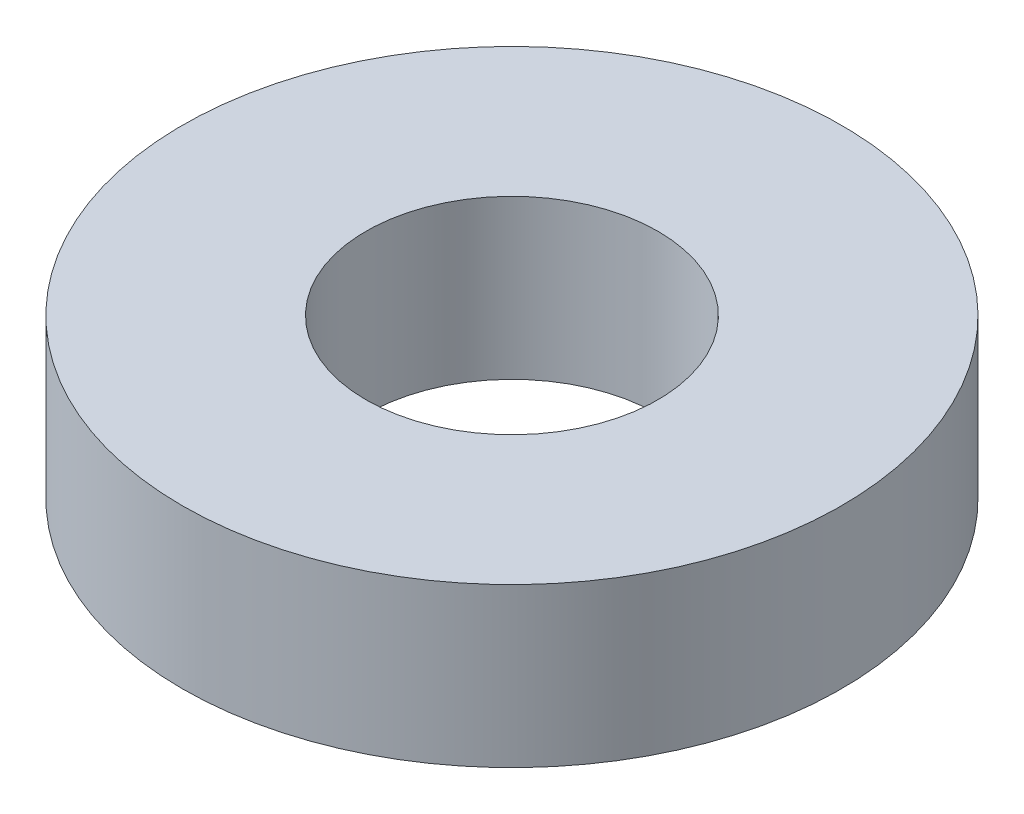
ISO-10303-21;
HEADER;
FILE_DESCRIPTION(('STEP AP214'),'2;1');
FILE_NAME('part.step','',(''),(''),'','','');
FILE_SCHEMA(('AUTOMOTIVE_DESIGN { 1 0 10303 214 1 1 1 1 }'));
ENDSEC;
DATA;
#1=APPLICATION_CONTEXT('core data for automotive mechanical design processes');
#2=APPLICATION_PROTOCOL_DEFINITION('international standard','automotive_design',2000,#1);
#3=PRODUCT_CONTEXT('',#1,'mechanical');
#4=PRODUCT('Part','Part','',(#3));
#5=PRODUCT_RELATED_PRODUCT_CATEGORY('part','',(#4));
#6=PRODUCT_DEFINITION_FORMATION('','',#4);
#7=PRODUCT_DEFINITION_CONTEXT('part definition',#1,'design');
#8=PRODUCT_DEFINITION('design','',#6,#7);
#9=PRODUCT_DEFINITION_SHAPE('','',#8);
#10=(LENGTH_UNIT() NAMED_UNIT(*) SI_UNIT(.MILLI.,.METRE.));
#11=(NAMED_UNIT(*) PLANE_ANGLE_UNIT() SI_UNIT($,.RADIAN.));
#12=(NAMED_UNIT(*) SI_UNIT($,.STERADIAN.) SOLID_ANGLE_UNIT());
#13=UNCERTAINTY_MEASURE_WITH_UNIT(LENGTH_MEASURE(1.E-05),#10,'distance_accuracy_value','');
#14=(GEOMETRIC_REPRESENTATION_CONTEXT(3) GLOBAL_UNCERTAINTY_ASSIGNED_CONTEXT((#13)) GLOBAL_UNIT_ASSIGNED_CONTEXT((#10,
#11,#12)) REPRESENTATION_CONTEXT('',''));
#15=CARTESIAN_POINT('',(0.,0.,0.));
#16=DIRECTION('',(0.,0.,1.));
#17=DIRECTION('',(1.,0.,0.));
#18=AXIS2_PLACEMENT_3D('',#15,#16,#17);
#19=CARTESIAN_POINT('',(0.,1.9,0.));
#20=DIRECTION('',(0.,1.,0.));
#21=DIRECTION('',(0.,0.,1.));
#22=AXIS2_PLACEMENT_3D('',#19,#20,#21);
#23=PLANE('',#22);
#24=CARTESIAN_POINT('',(0.,1.9,0.));
#25=DIRECTION('',(0.,1.,0.));
#26=DIRECTION('',(0.,0.,1.));
#27=AXIS2_PLACEMENT_3D('',#24,#25,#26);
#28=CIRCLE('',#27,3.95);
#29=CARTESIAN_POINT('',(0.,1.9,3.95));
#30=VERTEX_POINT('',#29);
#31=EDGE_CURVE('E10',#30,#30,#28,.T.);
#32=ORIENTED_EDGE('',*,*,#31,.T.);
#33=EDGE_LOOP('',(#32));
#34=FACE_BOUND('',#33,.T.);
#35=CARTESIAN_POINT('',(0.,1.9,0.));
#36=DIRECTION('',(0.,1.,0.));
#37=DIRECTION('',(0.,0.,1.));
#38=AXIS2_PLACEMENT_3D('',#35,#36,#37);
#39=CIRCLE('',#38,1.75);
#40=CARTESIAN_POINT('',(0.,1.9,1.75));
#41=VERTEX_POINT('',#40);
#42=EDGE_CURVE('E48',#41,#41,#39,.T.);
#43=ORIENTED_EDGE('',*,*,#42,.F.);
#44=EDGE_LOOP('',(#43));
#45=FACE_BOUND('',#44,.T.);
#46=ADVANCED_FACE('F40',(#34,#45),#23,.T.);
#47=CARTESIAN_POINT('',(0.,0.,0.));
#48=DIRECTION('',(0.,1.,0.));
#49=DIRECTION('',(0.,0.,1.));
#50=AXIS2_PLACEMENT_3D('',#47,#48,#49);
#51=PLANE('',#50);
#52=CARTESIAN_POINT('',(0.,0.,0.));
#53=DIRECTION('',(0.,1.,0.));
#54=DIRECTION('',(0.,0.,1.));
#55=AXIS2_PLACEMENT_3D('',#52,#53,#54);
#56=CIRCLE('',#55,3.95);
#57=CARTESIAN_POINT('',(0.,0.,3.95));
#58=VERTEX_POINT('',#57);
#59=EDGE_CURVE('E41',#58,#58,#56,.T.);
#60=ORIENTED_EDGE('',*,*,#59,.F.);
#61=EDGE_LOOP('',(#60));
#62=FACE_BOUND('',#61,.T.);
#63=CARTESIAN_POINT('',(0.,0.,0.));
#64=DIRECTION('',(0.,1.,0.));
#65=DIRECTION('',(0.,0.,1.));
#66=AXIS2_PLACEMENT_3D('',#63,#64,#65);
#67=CIRCLE('',#66,1.75);
#68=CARTESIAN_POINT('',(0.,0.,1.75));
#69=VERTEX_POINT('',#68);
#70=EDGE_CURVE('E49',#69,#69,#67,.T.);
#71=ORIENTED_EDGE('',*,*,#70,.T.);
#72=EDGE_LOOP('',(#71));
#73=FACE_BOUND('',#72,.T.);
#74=ADVANCED_FACE('F58',(#62,#73),#51,.F.);
#75=CARTESIAN_POINT('',(0.,1.9,0.));
#76=DIRECTION('',(0.,-1.,0.));
#77=DIRECTION('',(0.,0.,-1.));
#78=AXIS2_PLACEMENT_3D('',#75,#76,#77);
#79=CYLINDRICAL_SURFACE('',#78,3.95);
#80=ORIENTED_EDGE('',*,*,#31,.F.);
#81=EDGE_LOOP('',(#80));
#82=FACE_BOUND('',#81,.T.);
#83=ORIENTED_EDGE('',*,*,#59,.T.);
#84=EDGE_LOOP('',(#83));
#85=FACE_BOUND('',#84,.T.);
#86=ADVANCED_FACE('F39',(#82,#85),#79,.T.);
#87=CARTESIAN_POINT('',(0.,1.9,0.));
#88=DIRECTION('',(0.,-1.,0.));
#89=DIRECTION('',(0.,0.,-1.));
#90=AXIS2_PLACEMENT_3D('',#87,#88,#89);
#91=CYLINDRICAL_SURFACE('',#90,1.75);
#92=ORIENTED_EDGE('',*,*,#42,.T.);
#93=EDGE_LOOP('',(#92));
#94=FACE_BOUND('',#93,.T.);
#95=ORIENTED_EDGE('',*,*,#70,.F.);
#96=EDGE_LOOP('',(#95));
#97=FACE_BOUND('',#96,.T.);
#98=ADVANCED_FACE('F57',(#94,#97),#91,.F.);
#99=CLOSED_SHELL('',(#46,#74,#86,#98));
#100=MANIFOLD_SOLID_BREP('B2',#99);
#101=ADVANCED_BREP_SHAPE_REPRESENTATION('',(#18,#100),#14);
#102=SHAPE_DEFINITION_REPRESENTATION(#9,#101);
ENDSEC;
END-ISO-10303-21;
